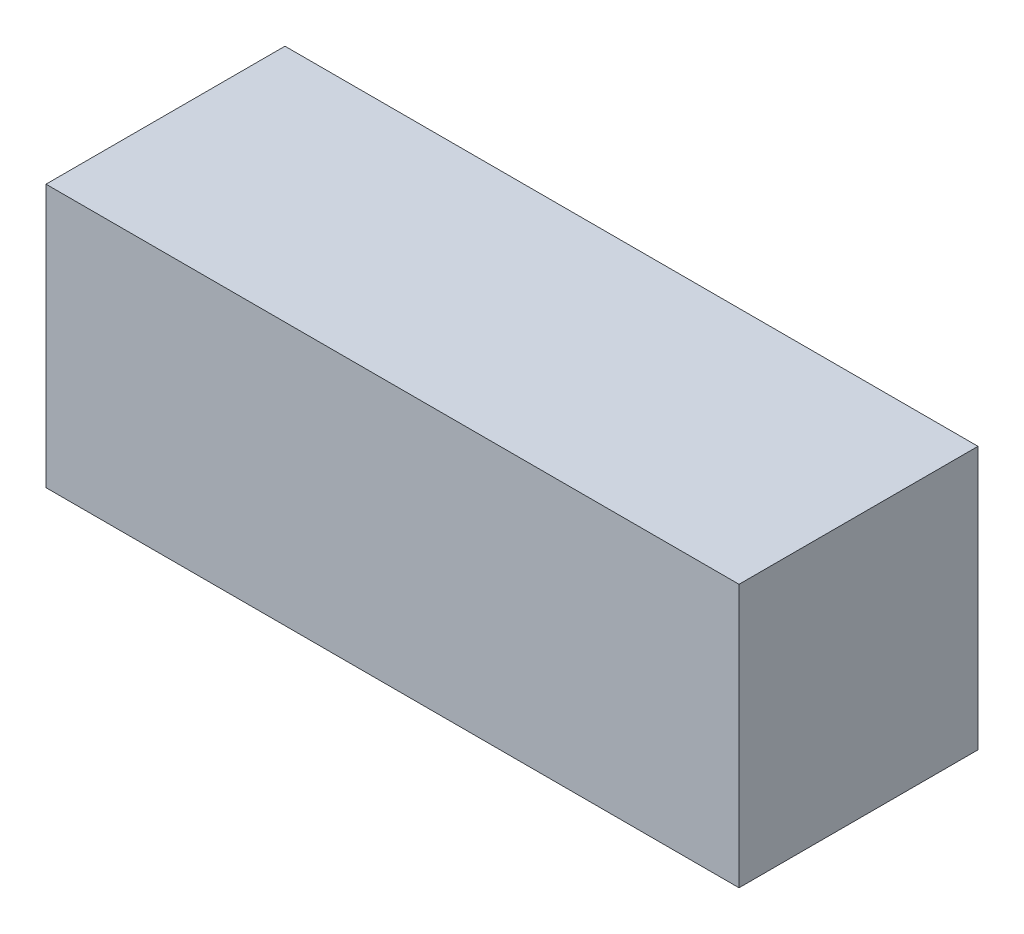
ISO-10303-21;
HEADER;
FILE_DESCRIPTION(('STEP AP214'),'2;1');
FILE_NAME('part.step','',(''),(''),'','','');
FILE_SCHEMA(('AUTOMOTIVE_DESIGN { 1 0 10303 214 1 1 1 1 }'));
ENDSEC;
DATA;
#1=APPLICATION_CONTEXT('core data for automotive mechanical design processes');
#2=APPLICATION_PROTOCOL_DEFINITION('international standard','automotive_design',2000,#1);
#3=PRODUCT_CONTEXT('',#1,'mechanical');
#4=PRODUCT('Part','Part','',(#3));
#5=PRODUCT_RELATED_PRODUCT_CATEGORY('part','',(#4));
#6=PRODUCT_DEFINITION_FORMATION('','',#4);
#7=PRODUCT_DEFINITION_CONTEXT('part definition',#1,'design');
#8=PRODUCT_DEFINITION('design','',#6,#7);
#9=PRODUCT_DEFINITION_SHAPE('','',#8);
#10=(LENGTH_UNIT() NAMED_UNIT(*) SI_UNIT(.MILLI.,.METRE.));
#11=(NAMED_UNIT(*) PLANE_ANGLE_UNIT() SI_UNIT($,.RADIAN.));
#12=(NAMED_UNIT(*) SI_UNIT($,.STERADIAN.) SOLID_ANGLE_UNIT());
#13=UNCERTAINTY_MEASURE_WITH_UNIT(LENGTH_MEASURE(1.E-05),#10,'distance_accuracy_value','');
#14=(GEOMETRIC_REPRESENTATION_CONTEXT(3) GLOBAL_UNCERTAINTY_ASSIGNED_CONTEXT((#13)) GLOBAL_UNIT_ASSIGNED_CONTEXT((#10,
#11,#12)) REPRESENTATION_CONTEXT('',''));
#15=CARTESIAN_POINT('',(0.,0.,0.));
#16=DIRECTION('',(0.,0.,1.));
#17=DIRECTION('',(1.,0.,0.));
#18=AXIS2_PLACEMENT_3D('',#15,#16,#17);
#19=CARTESIAN_POINT('',(-0.509999988824129,-11.1099997518957,2.));
#20=DIRECTION('',(0.,0.,1.));
#21=DIRECTION('',(1.,0.,0.));
#22=AXIS2_PLACEMENT_3D('',#19,#20,#21);
#23=PLANE('',#22);
#24=DIRECTION('',(1.,0.,0.));
#25=VECTOR('',#24,1.);
#26=CARTESIAN_POINT('',(0.949999978765846,-9.99999977648258,2.));
#27=LINE('',#26,#25);
#28=CARTESIAN_POINT('',(-0.499999988824129,-9.99999977648258,2.));
#29=VERTEX_POINT('',#28);
#30=CARTESIAN_POINT('',(2.39999994635582,-9.99999977648258,2.));
#31=VERTEX_POINT('',#30);
#32=EDGE_CURVE('E63',#29,#31,#27,.T.);
#33=ORIENTED_EDGE('',*,*,#32,.F.);
#34=DIRECTION('',(0.,-1.,0.));
#35=VECTOR('',#34,1.);
#36=CARTESIAN_POINT('',(-0.499999988824129,-10.5499997641891,2.));
#37=LINE('',#36,#35);
#38=CARTESIAN_POINT('',(-0.499999988824129,-11.0999997518957,2.));
#39=VERTEX_POINT('',#38);
#40=EDGE_CURVE('E20',#29,#39,#37,.T.);
#41=ORIENTED_EDGE('',*,*,#40,.T.);
#42=DIRECTION('',(-1.,0.,0.));
#43=VECTOR('',#42,1.);
#44=CARTESIAN_POINT('',(0.949999978765846,-11.0999997518957,2.));
#45=LINE('',#44,#43);
#46=CARTESIAN_POINT('',(2.39999994635582,-11.0999997518957,2.));
#47=VERTEX_POINT('',#46);
#48=EDGE_CURVE('E71',#47,#39,#45,.T.);
#49=ORIENTED_EDGE('',*,*,#48,.F.);
#50=DIRECTION('',(0.,-1.,0.));
#51=VECTOR('',#50,1.);
#52=CARTESIAN_POINT('',(2.39999994635582,-10.5499997641891,2.));
#53=LINE('',#52,#51);
#54=EDGE_CURVE('E57',#31,#47,#53,.T.);
#55=ORIENTED_EDGE('',*,*,#54,.F.);
#56=EDGE_LOOP('',(#33,#41,#49,#55));
#57=FACE_BOUND('',#56,.T.);
#58=ADVANCED_FACE('F16',(#57),#23,.T.);
#59=CARTESIAN_POINT('',(2.40999994635582,-9.99999977648258,0.99));
#60=DIRECTION('',(0.,1.,0.));
#61=DIRECTION('',(-1.,0.,0.));
#62=AXIS2_PLACEMENT_3D('',#59,#60,#61);
#63=PLANE('',#62);
#64=ORIENTED_EDGE('',*,*,#32,.T.);
#65=DIRECTION('',(0.,0.,1.));
#66=VECTOR('',#65,1.);
#67=CARTESIAN_POINT('',(2.39999994635582,-9.99999977648258,1.5));
#68=LINE('',#67,#66);
#69=CARTESIAN_POINT('',(2.39999994635582,-9.99999977648258,1.));
#70=VERTEX_POINT('',#69);
#71=EDGE_CURVE('E65',#70,#31,#68,.T.);
#72=ORIENTED_EDGE('',*,*,#71,.F.);
#73=DIRECTION('',(1.,0.,0.));
#74=VECTOR('',#73,1.);
#75=CARTESIAN_POINT('',(0.949999978765846,-9.99999977648258,1.));
#76=LINE('',#75,#74);
#77=CARTESIAN_POINT('',(-0.499999988824129,-9.99999977648258,1.));
#78=VERTEX_POINT('',#77);
#79=EDGE_CURVE('E93',#78,#70,#76,.T.);
#80=ORIENTED_EDGE('',*,*,#79,.F.);
#81=DIRECTION('',(0.,0.,-1.));
#82=VECTOR('',#81,1.);
#83=CARTESIAN_POINT('',(-0.499999988824129,-9.99999977648258,1.5));
#84=LINE('',#83,#82);
#85=EDGE_CURVE('E68',#29,#78,#84,.T.);
#86=ORIENTED_EDGE('',*,*,#85,.F.);
#87=EDGE_LOOP('',(#64,#72,#80,#86));
#88=FACE_BOUND('',#87,.T.);
#89=ADVANCED_FACE('F64',(#88),#63,.T.);
#90=CARTESIAN_POINT('',(2.39999994635582,-11.1099997518957,0.99));
#91=DIRECTION('',(1.,0.,0.));
#92=DIRECTION('',(0.,1.,0.));
#93=AXIS2_PLACEMENT_3D('',#90,#91,#92);
#94=PLANE('',#93);
#95=ORIENTED_EDGE('',*,*,#54,.T.);
#96=DIRECTION('',(0.,0.,1.));
#97=VECTOR('',#96,1.);
#98=CARTESIAN_POINT('',(2.39999994635582,-11.0999997518957,1.5));
#99=LINE('',#98,#97);
#100=CARTESIAN_POINT('',(2.39999994635582,-11.0999997518957,1.));
#101=VERTEX_POINT('',#100);
#102=EDGE_CURVE('E74',#101,#47,#99,.T.);
#103=ORIENTED_EDGE('',*,*,#102,.F.);
#104=DIRECTION('',(0.,-1.,0.));
#105=VECTOR('',#104,1.);
#106=CARTESIAN_POINT('',(2.39999994635582,-10.5499997641891,1.));
#107=LINE('',#106,#105);
#108=EDGE_CURVE('E78',#70,#101,#107,.T.);
#109=ORIENTED_EDGE('',*,*,#108,.F.);
#110=ORIENTED_EDGE('',*,*,#71,.T.);
#111=EDGE_LOOP('',(#95,#103,#109,#110));
#112=FACE_BOUND('',#111,.T.);
#113=ADVANCED_FACE('F76',(#112),#94,.T.);
#114=CARTESIAN_POINT('',(-0.509999988824129,-11.0999997518957,0.99));
#115=DIRECTION('',(0.,-1.,0.));
#116=DIRECTION('',(1.,0.,0.));
#117=AXIS2_PLACEMENT_3D('',#114,#115,#116);
#118=PLANE('',#117);
#119=ORIENTED_EDGE('',*,*,#48,.T.);
#120=DIRECTION('',(0.,0.,1.));
#121=VECTOR('',#120,1.);
#122=CARTESIAN_POINT('',(-0.499999988824129,-11.0999997518957,1.5));
#123=LINE('',#122,#121);
#124=CARTESIAN_POINT('',(-0.499999988824129,-11.0999997518957,1.));
#125=VERTEX_POINT('',#124);
#126=EDGE_CURVE('E36',#125,#39,#123,.T.);
#127=ORIENTED_EDGE('',*,*,#126,.F.);
#128=DIRECTION('',(-1.,0.,0.));
#129=VECTOR('',#128,1.);
#130=CARTESIAN_POINT('',(0.949999978765846,-11.0999997518957,1.));
#131=LINE('',#130,#129);
#132=EDGE_CURVE('E27',#101,#125,#131,.T.);
#133=ORIENTED_EDGE('',*,*,#132,.F.);
#134=ORIENTED_EDGE('',*,*,#102,.T.);
#135=EDGE_LOOP('',(#119,#127,#133,#134));
#136=FACE_BOUND('',#135,.T.);
#137=ADVANCED_FACE('F100',(#136),#118,.T.);
#138=CARTESIAN_POINT('',(-0.499999988824129,-9.98999977648258,0.99));
#139=DIRECTION('',(-1.,0.,0.));
#140=DIRECTION('',(0.,-1.,0.));
#141=AXIS2_PLACEMENT_3D('',#138,#139,#140);
#142=PLANE('',#141);
#143=ORIENTED_EDGE('',*,*,#40,.F.);
#144=ORIENTED_EDGE('',*,*,#85,.T.);
#145=DIRECTION('',(0.,1.,0.));
#146=VECTOR('',#145,1.);
#147=CARTESIAN_POINT('',(-0.499999988824129,-10.5499997641891,1.));
#148=LINE('',#147,#146);
#149=EDGE_CURVE('E11',#125,#78,#148,.T.);
#150=ORIENTED_EDGE('',*,*,#149,.F.);
#151=ORIENTED_EDGE('',*,*,#126,.T.);
#152=EDGE_LOOP('',(#143,#144,#150,#151));
#153=FACE_BOUND('',#152,.T.);
#154=ADVANCED_FACE('F102',(#153),#142,.T.);
#155=CARTESIAN_POINT('',(2.40999994635582,-11.1099997518957,1.));
#156=DIRECTION('',(0.,0.,-1.));
#157=DIRECTION('',(-1.,0.,0.));
#158=AXIS2_PLACEMENT_3D('',#155,#156,#157);
#159=PLANE('',#158);
#160=ORIENTED_EDGE('',*,*,#132,.T.);
#161=ORIENTED_EDGE('',*,*,#149,.T.);
#162=ORIENTED_EDGE('',*,*,#79,.T.);
#163=ORIENTED_EDGE('',*,*,#108,.T.);
#164=EDGE_LOOP('',(#160,#161,#162,#163));
#165=FACE_BOUND('',#164,.T.);
#166=ADVANCED_FACE('F18',(#165),#159,.T.);
#167=CLOSED_SHELL('',(#58,#89,#113,#137,#154,#166));
#168=MANIFOLD_SOLID_BREP('B1',#167);
#169=ADVANCED_BREP_SHAPE_REPRESENTATION('',(#18,#168),#14);
#170=SHAPE_DEFINITION_REPRESENTATION(#9,#169);
ENDSEC;
END-ISO-10303-21;
